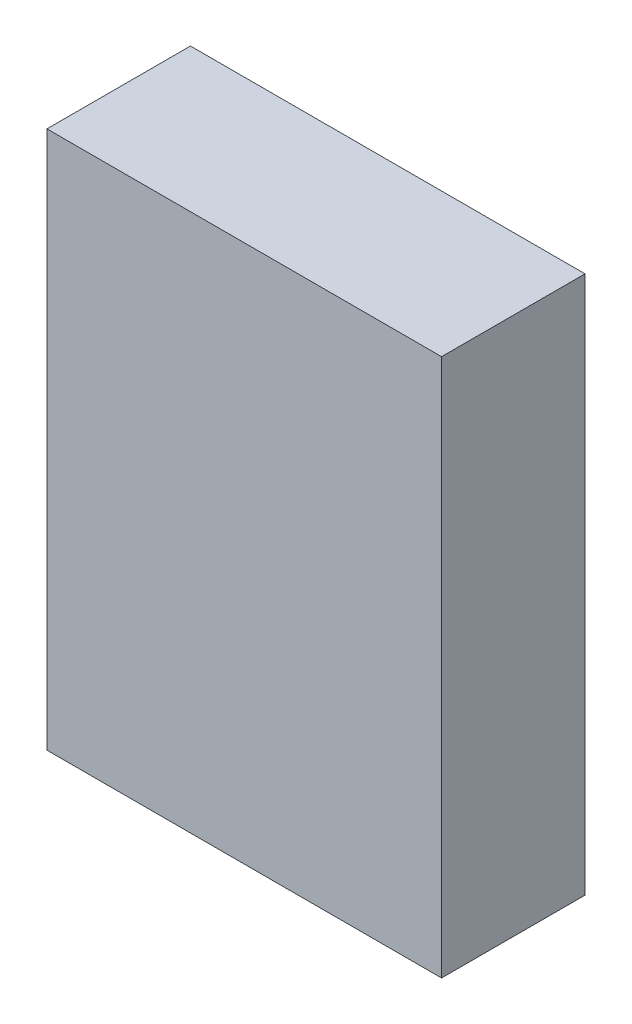
ISO-10303-21;
HEADER;
FILE_DESCRIPTION(('STEP AP214'),'2;1');
FILE_NAME('part.step','',(''),(''),'','','');
FILE_SCHEMA(('AUTOMOTIVE_DESIGN { 1 0 10303 214 1 1 1 1 }'));
ENDSEC;
DATA;
#1=APPLICATION_CONTEXT('core data for automotive mechanical design processes');
#2=APPLICATION_PROTOCOL_DEFINITION('international standard','automotive_design',2000,#1);
#3=PRODUCT_CONTEXT('',#1,'mechanical');
#4=PRODUCT('Part','Part','',(#3));
#5=PRODUCT_RELATED_PRODUCT_CATEGORY('part','',(#4));
#6=PRODUCT_DEFINITION_FORMATION('','',#4);
#7=PRODUCT_DEFINITION_CONTEXT('part definition',#1,'design');
#8=PRODUCT_DEFINITION('design','',#6,#7);
#9=PRODUCT_DEFINITION_SHAPE('','',#8);
#10=(LENGTH_UNIT() NAMED_UNIT(*) SI_UNIT(.MILLI.,.METRE.));
#11=(NAMED_UNIT(*) PLANE_ANGLE_UNIT() SI_UNIT($,.RADIAN.));
#12=(NAMED_UNIT(*) SI_UNIT($,.STERADIAN.) SOLID_ANGLE_UNIT());
#13=UNCERTAINTY_MEASURE_WITH_UNIT(LENGTH_MEASURE(1.E-05),#10,'distance_accuracy_value','');
#14=(GEOMETRIC_REPRESENTATION_CONTEXT(3) GLOBAL_UNCERTAINTY_ASSIGNED_CONTEXT((#13)) GLOBAL_UNIT_ASSIGNED_CONTEXT((#10,
#11,#12)) REPRESENTATION_CONTEXT('',''));
#15=CARTESIAN_POINT('',(0.,0.,0.));
#16=DIRECTION('',(0.,0.,1.));
#17=DIRECTION('',(1.,0.,0.));
#18=AXIS2_PLACEMENT_3D('',#15,#16,#17);
#19=CARTESIAN_POINT('',(-52.7698845016496,39.8917945690673,40.));
#20=DIRECTION('',(1.,0.,0.));
#21=DIRECTION('',(0.,1.,0.));
#22=AXIS2_PLACEMENT_3D('',#19,#20,#21);
#23=PLANE('',#22);
#24=DIRECTION('',(0.,-1.,0.));
#25=VECTOR('',#24,1.);
#26=CARTESIAN_POINT('',(-52.7698845016496,39.8917945690673,0.));
#27=LINE('',#26,#25);
#28=CARTESIAN_POINT('',(-52.7698845016496,39.8917945690673,0.));
#29=VERTEX_POINT('',#28);
#30=CARTESIAN_POINT('',(-52.7698845016495,-110.108205430933,0.));
#31=VERTEX_POINT('',#30);
#32=EDGE_CURVE('E95',#29,#31,#27,.T.);
#33=ORIENTED_EDGE('',*,*,#32,.T.);
#34=DIRECTION('',(0.,0.,-1.));
#35=VECTOR('',#34,1.);
#36=CARTESIAN_POINT('',(-52.7698845016495,-110.108205430933,40.));
#37=LINE('',#36,#35);
#38=CARTESIAN_POINT('',(-52.7698845016495,-110.108205430933,40.));
#39=VERTEX_POINT('',#38);
#40=EDGE_CURVE('E11',#39,#31,#37,.T.);
#41=ORIENTED_EDGE('',*,*,#40,.F.);
#42=DIRECTION('',(0.,-1.,0.));
#43=VECTOR('',#42,1.);
#44=CARTESIAN_POINT('',(-52.7698845016496,39.8917945690673,40.));
#45=LINE('',#44,#43);
#46=CARTESIAN_POINT('',(-52.7698845016496,39.8917945690673,40.));
#47=VERTEX_POINT('',#46);
#48=EDGE_CURVE('E83',#47,#39,#45,.T.);
#49=ORIENTED_EDGE('',*,*,#48,.F.);
#50=DIRECTION('',(0.,0.,-1.));
#51=VECTOR('',#50,1.);
#52=CARTESIAN_POINT('',(-52.7698845016496,39.8917945690673,40.));
#53=LINE('',#52,#51);
#54=EDGE_CURVE('E91',#47,#29,#53,.T.);
#55=ORIENTED_EDGE('',*,*,#54,.T.);
#56=EDGE_LOOP('',(#33,#41,#49,#55));
#57=FACE_BOUND('',#56,.T.);
#58=ADVANCED_FACE('F32',(#57),#23,.F.);
#59=CARTESIAN_POINT('',(-52.7698845016495,-110.108205430933,40.));
#60=DIRECTION('',(0.,1.,0.));
#61=DIRECTION('',(0.,0.,1.));
#62=AXIS2_PLACEMENT_3D('',#59,#60,#61);
#63=PLANE('',#62);
#64=DIRECTION('',(1.,0.,0.));
#65=VECTOR('',#64,1.);
#66=CARTESIAN_POINT('',(-52.7698845016495,-110.108205430933,0.));
#67=LINE('',#66,#65);
#68=CARTESIAN_POINT('',(57.2301154983504,-110.108205430933,0.));
#69=VERTEX_POINT('',#68);
#70=EDGE_CURVE('E87',#31,#69,#67,.T.);
#71=ORIENTED_EDGE('',*,*,#70,.T.);
#72=DIRECTION('',(0.,0.,-1.));
#73=VECTOR('',#72,1.);
#74=CARTESIAN_POINT('',(57.2301154983504,-110.108205430933,40.));
#75=LINE('',#74,#73);
#76=CARTESIAN_POINT('',(57.2301154983504,-110.108205430933,40.));
#77=VERTEX_POINT('',#76);
#78=EDGE_CURVE('E40',#77,#69,#75,.T.);
#79=ORIENTED_EDGE('',*,*,#78,.F.);
#80=DIRECTION('',(1.,0.,0.));
#81=VECTOR('',#80,1.);
#82=CARTESIAN_POINT('',(-52.7698845016495,-110.108205430933,40.));
#83=LINE('',#82,#81);
#84=EDGE_CURVE('E78',#39,#77,#83,.T.);
#85=ORIENTED_EDGE('',*,*,#84,.F.);
#86=ORIENTED_EDGE('',*,*,#40,.T.);
#87=EDGE_LOOP('',(#71,#79,#85,#86));
#88=FACE_BOUND('',#87,.T.);
#89=ADVANCED_FACE('F86',(#88),#63,.F.);
#90=CARTESIAN_POINT('',(57.2301154983504,39.8917945690673,40.));
#91=DIRECTION('',(-1.,0.,0.));
#92=DIRECTION('',(0.,-1.,0.));
#93=AXIS2_PLACEMENT_3D('',#90,#91,#92);
#94=PLANE('',#93);
#95=DIRECTION('',(0.,1.,0.));
#96=VECTOR('',#95,1.);
#97=CARTESIAN_POINT('',(57.2301154983504,39.8917945690673,0.));
#98=LINE('',#97,#96);
#99=CARTESIAN_POINT('',(57.2301154983504,39.8917945690673,0.));
#100=VERTEX_POINT('',#99);
#101=EDGE_CURVE('E65',#69,#100,#98,.T.);
#102=ORIENTED_EDGE('',*,*,#101,.T.);
#103=DIRECTION('',(0.,0.,-1.));
#104=VECTOR('',#103,1.);
#105=CARTESIAN_POINT('',(57.2301154983504,39.8917945690673,40.));
#106=LINE('',#105,#104);
#107=CARTESIAN_POINT('',(57.2301154983504,39.8917945690673,40.));
#108=VERTEX_POINT('',#107);
#109=EDGE_CURVE('E88',#108,#100,#106,.T.);
#110=ORIENTED_EDGE('',*,*,#109,.F.);
#111=DIRECTION('',(0.,1.,0.));
#112=VECTOR('',#111,1.);
#113=CARTESIAN_POINT('',(57.2301154983504,39.8917945690673,40.));
#114=LINE('',#113,#112);
#115=EDGE_CURVE('E81',#77,#108,#114,.T.);
#116=ORIENTED_EDGE('',*,*,#115,.F.);
#117=ORIENTED_EDGE('',*,*,#78,.T.);
#118=EDGE_LOOP('',(#102,#110,#116,#117));
#119=FACE_BOUND('',#118,.T.);
#120=ADVANCED_FACE('F89',(#119),#94,.F.);
#121=CARTESIAN_POINT('',(-52.7698845016496,39.8917945690673,40.));
#122=DIRECTION('',(0.,-1.,0.));
#123=DIRECTION('',(0.,0.,-1.));
#124=AXIS2_PLACEMENT_3D('',#121,#122,#123);
#125=PLANE('',#124);
#126=DIRECTION('',(-1.,0.,0.));
#127=VECTOR('',#126,1.);
#128=CARTESIAN_POINT('',(-52.7698845016496,39.8917945690673,0.));
#129=LINE('',#128,#127);
#130=EDGE_CURVE('E71',#100,#29,#129,.T.);
#131=ORIENTED_EDGE('',*,*,#130,.T.);
#132=ORIENTED_EDGE('',*,*,#54,.F.);
#133=DIRECTION('',(-1.,0.,0.));
#134=VECTOR('',#133,1.);
#135=CARTESIAN_POINT('',(-52.7698845016496,39.8917945690673,40.));
#136=LINE('',#135,#134);
#137=EDGE_CURVE('E48',#108,#47,#136,.T.);
#138=ORIENTED_EDGE('',*,*,#137,.F.);
#139=ORIENTED_EDGE('',*,*,#109,.T.);
#140=EDGE_LOOP('',(#131,#132,#138,#139));
#141=FACE_BOUND('',#140,.T.);
#142=ADVANCED_FACE('F102',(#141),#125,.F.);
#143=CARTESIAN_POINT('',(0.,0.,40.));
#144=DIRECTION('',(0.,0.,1.));
#145=DIRECTION('',(1.,0.,0.));
#146=AXIS2_PLACEMENT_3D('',#143,#144,#145);
#147=PLANE('',#146);
#148=ORIENTED_EDGE('',*,*,#48,.T.);
#149=ORIENTED_EDGE('',*,*,#84,.T.);
#150=ORIENTED_EDGE('',*,*,#115,.T.);
#151=ORIENTED_EDGE('',*,*,#137,.T.);
#152=EDGE_LOOP('',(#148,#149,#150,#151));
#153=FACE_BOUND('',#152,.T.);
#154=ADVANCED_FACE('F79',(#153),#147,.T.);
#155=CARTESIAN_POINT('',(0.,0.,0.));
#156=DIRECTION('',(0.,0.,1.));
#157=DIRECTION('',(1.,0.,0.));
#158=AXIS2_PLACEMENT_3D('',#155,#156,#157);
#159=PLANE('',#158);
#160=ORIENTED_EDGE('',*,*,#32,.F.);
#161=ORIENTED_EDGE('',*,*,#130,.F.);
#162=ORIENTED_EDGE('',*,*,#101,.F.);
#163=ORIENTED_EDGE('',*,*,#70,.F.);
#164=EDGE_LOOP('',(#160,#161,#162,#163));
#165=FACE_BOUND('',#164,.T.);
#166=ADVANCED_FACE('F105',(#165),#159,.F.);
#167=CLOSED_SHELL('',(#58,#89,#120,#142,#154,#166));
#168=MANIFOLD_SOLID_BREP('B2',#167);
#169=ADVANCED_BREP_SHAPE_REPRESENTATION('',(#18,#168),#14);
#170=SHAPE_DEFINITION_REPRESENTATION(#9,#169);
ENDSEC;
END-ISO-10303-21;
